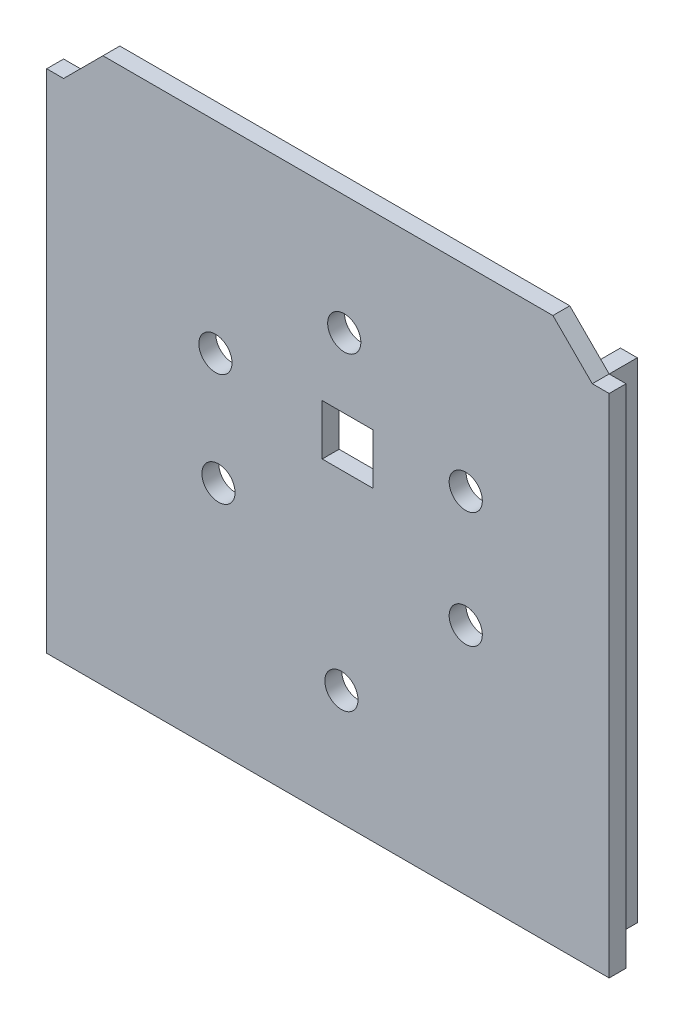
ISO-10303-21;
HEADER;
FILE_DESCRIPTION(('STEP AP214'),'2;1');
FILE_NAME('part.step','',(''),(''),'','','');
FILE_SCHEMA(('AUTOMOTIVE_DESIGN { 1 0 10303 214 1 1 1 1 }'));
ENDSEC;
DATA;
#1=APPLICATION_CONTEXT('core data for automotive mechanical design processes');
#2=APPLICATION_PROTOCOL_DEFINITION('international standard','automotive_design',2000,#1);
#3=PRODUCT_CONTEXT('',#1,'mechanical');
#4=PRODUCT('Part','Part','',(#3));
#5=PRODUCT_RELATED_PRODUCT_CATEGORY('part','',(#4));
#6=PRODUCT_DEFINITION_FORMATION('','',#4);
#7=PRODUCT_DEFINITION_CONTEXT('part definition',#1,'design');
#8=PRODUCT_DEFINITION('design','',#6,#7);
#9=PRODUCT_DEFINITION_SHAPE('','',#8);
#10=(LENGTH_UNIT() NAMED_UNIT(*) SI_UNIT(.MILLI.,.METRE.));
#11=(NAMED_UNIT(*) PLANE_ANGLE_UNIT() SI_UNIT($,.RADIAN.));
#12=(NAMED_UNIT(*) SI_UNIT($,.STERADIAN.) SOLID_ANGLE_UNIT());
#13=UNCERTAINTY_MEASURE_WITH_UNIT(LENGTH_MEASURE(1.E-05),#10,'distance_accuracy_value','');
#14=(GEOMETRIC_REPRESENTATION_CONTEXT(3) GLOBAL_UNCERTAINTY_ASSIGNED_CONTEXT((#13)) GLOBAL_UNIT_ASSIGNED_CONTEXT((#10,
#11,#12)) REPRESENTATION_CONTEXT('',''));
#15=CARTESIAN_POINT('',(0.,0.,0.));
#16=DIRECTION('',(0.,0.,1.));
#17=DIRECTION('',(1.,0.,0.));
#18=AXIS2_PLACEMENT_3D('',#15,#16,#17);
#19=CARTESIAN_POINT('',(0.,0.,-0.156260386575012));
#20=DIRECTION('',(0.,0.,-1.));
#21=DIRECTION('',(-1.,0.,0.));
#22=AXIS2_PLACEMENT_3D('',#19,#20,#21);
#23=PLANE('',#22);
#24=DIRECTION('',(0.,-1.,0.));
#25=VECTOR('',#24,1.);
#26=CARTESIAN_POINT('',(51.2611254994336,-24.011326905624,-0.156260386575012));
#27=LINE('',#26,#25);
#28=CARTESIAN_POINT('',(51.2611254994336,62.988673094376,-0.156260386575012));
#29=VERTEX_POINT('',#28);
#30=CARTESIAN_POINT('',(51.2611254994336,-24.011326905624,-0.156260386575012));
#31=VERTEX_POINT('',#30);
#32=EDGE_CURVE('E195',#29,#31,#27,.T.);
#33=ORIENTED_EDGE('',*,*,#32,.F.);
#34=DIRECTION('',(-1.,0.,0.));
#35=VECTOR('',#34,1.);
#36=CARTESIAN_POINT('',(51.2611254994336,62.988673094376,-0.156260386575012));
#37=LINE('',#36,#35);
#38=CARTESIAN_POINT('',(54.2611254994336,62.988673094376,-0.156260386575012));
#39=VERTEX_POINT('',#38);
#40=EDGE_CURVE('E291',#39,#29,#37,.T.);
#41=ORIENTED_EDGE('',*,*,#40,.F.);
#42=DIRECTION('',(0.,1.,0.));
#43=VECTOR('',#42,1.);
#44=CARTESIAN_POINT('',(54.2611254994336,62.988673094376,-0.156260386575012));
#45=LINE('',#44,#43);
#46=CARTESIAN_POINT('',(54.2611254994337,-27.011326905624,-0.156260386575012));
#47=VERTEX_POINT('',#46);
#48=EDGE_CURVE('E300',#47,#39,#45,.T.);
#49=ORIENTED_EDGE('',*,*,#48,.F.);
#50=DIRECTION('',(1.,0.,0.));
#51=VECTOR('',#50,1.);
#52=CARTESIAN_POINT('',(-45.7388745005664,-27.011326905624,-0.156260386575012));
#53=LINE('',#52,#51);
#54=CARTESIAN_POINT('',(-45.7388745005664,-27.011326905624,-0.156260386575012));
#55=VERTEX_POINT('',#54);
#56=EDGE_CURVE('E341',#55,#47,#53,.T.);
#57=ORIENTED_EDGE('',*,*,#56,.F.);
#58=DIRECTION('',(0.,-1.,0.));
#59=VECTOR('',#58,1.);
#60=CARTESIAN_POINT('',(-45.7388745005664,62.988673094376,-0.156260386575012));
#61=LINE('',#60,#59);
#62=CARTESIAN_POINT('',(-45.7388745005664,62.988673094376,-0.156260386575012));
#63=VERTEX_POINT('',#62);
#64=EDGE_CURVE('E338',#63,#55,#61,.T.);
#65=ORIENTED_EDGE('',*,*,#64,.F.);
#66=DIRECTION('',(-1.,0.,0.));
#67=VECTOR('',#66,1.);
#68=CARTESIAN_POINT('',(-42.7388745005664,62.988673094376,-0.156260386575012));
#69=LINE('',#68,#67);
#70=CARTESIAN_POINT('',(-42.7388745005664,62.988673094376,-0.156260386575012));
#71=VERTEX_POINT('',#70);
#72=EDGE_CURVE('E335',#71,#63,#69,.T.);
#73=ORIENTED_EDGE('',*,*,#72,.F.);
#74=DIRECTION('',(0.,1.,0.));
#75=VECTOR('',#74,1.);
#76=CARTESIAN_POINT('',(-42.7388745005664,62.988673094376,-0.156260386575012));
#77=LINE('',#76,#75);
#78=CARTESIAN_POINT('',(-42.7388745005664,-24.011326905624,-0.156260386575012));
#79=VERTEX_POINT('',#78);
#80=EDGE_CURVE('E394',#79,#71,#77,.T.);
#81=ORIENTED_EDGE('',*,*,#80,.F.);
#82=DIRECTION('',(-1.,0.,0.));
#83=VECTOR('',#82,1.);
#84=CARTESIAN_POINT('',(-42.7388745005664,-24.011326905624,-0.156260386575012));
#85=LINE('',#84,#83);
#86=EDGE_CURVE('E402',#31,#79,#85,.T.);
#87=ORIENTED_EDGE('',*,*,#86,.F.);
#88=EDGE_LOOP('',(#33,#41,#49,#57,#65,#73,#81,#87));
#89=FACE_BOUND('',#88,.T.);
#90=ADVANCED_FACE('F39',(#89),#23,.T.);
#91=CARTESIAN_POINT('',(0.,0.,2.84373961342499));
#92=DIRECTION('',(0.,0.,-1.));
#93=DIRECTION('',(-1.,0.,0.));
#94=AXIS2_PLACEMENT_3D('',#91,#92,#93);
#95=PLANE('',#94);
#96=CARTESIAN_POINT('',(-15.738875683346,34.1704455946526,2.84373961342499));
#97=DIRECTION('',(0.,0.,1.));
#98=DIRECTION('',(1.,0.,0.));
#99=AXIS2_PLACEMENT_3D('',#96,#97,#98);
#100=CIRCLE('',#99,2.95000117238807);
#101=CARTESIAN_POINT('',(-12.788874510958,34.1704455946526,2.84373961342499));
#102=VERTEX_POINT('',#101);
#103=EDGE_CURVE('E247',#102,#102,#100,.T.);
#104=ORIENTED_EDGE('',*,*,#103,.F.);
#105=EDGE_LOOP('',(#104));
#106=FACE_BOUND('',#105,.T.);
#107=CARTESIAN_POINT('',(-15.1988725028422,14.4704436694226,2.84373961342499));
#108=DIRECTION('',(0.,0.,1.));
#109=DIRECTION('',(1.,0.,0.));
#110=AXIS2_PLACEMENT_3D('',#107,#108,#109);
#111=CIRCLE('',#110,2.95000117238807);
#112=CARTESIAN_POINT('',(-12.2488713304541,14.4704436694226,2.84373961342499));
#113=VERTEX_POINT('',#112);
#114=EDGE_CURVE('E255',#113,#113,#111,.T.);
#115=ORIENTED_EDGE('',*,*,#114,.F.);
#116=EDGE_LOOP('',(#115));
#117=FACE_BOUND('',#116,.T.);
#118=CARTESIAN_POINT('',(6.66112724324203,-6.52955907425374,2.84373961342499));
#119=DIRECTION('',(0.,0.,1.));
#120=DIRECTION('',(1.,0.,0.));
#121=AXIS2_PLACEMENT_3D('',#118,#119,#120);
#122=CIRCLE('',#121,2.95000117238807);
#123=CARTESIAN_POINT('',(9.6111284156301,-6.52955907425374,2.84373961342499));
#124=VERTEX_POINT('',#123);
#125=EDGE_CURVE('E263',#124,#124,#122,.T.);
#126=ORIENTED_EDGE('',*,*,#125,.F.);
#127=EDGE_LOOP('',(#126));
#128=FACE_BOUND('',#127,.T.);
#129=CARTESIAN_POINT('',(28.7611250915144,14.5704434995493,2.84373961342499));
#130=DIRECTION('',(0.,0.,1.));
#131=DIRECTION('',(1.,0.,0.));
#132=AXIS2_PLACEMENT_3D('',#129,#130,#131);
#133=CIRCLE('',#132,2.95000117238806);
#134=CARTESIAN_POINT('',(31.7111262639024,14.5704434995493,2.84373961342499));
#135=VERTEX_POINT('',#134);
#136=EDGE_CURVE('E271',#135,#135,#133,.T.);
#137=ORIENTED_EDGE('',*,*,#136,.F.);
#138=EDGE_LOOP('',(#137));
#139=FACE_BOUND('',#138,.T.);
#140=CARTESIAN_POINT('',(28.7611250915144,35.1704438959202,2.84373961342499));
#141=DIRECTION('',(0.,0.,1.));
#142=DIRECTION('',(1.,0.,0.));
#143=AXIS2_PLACEMENT_3D('',#140,#141,#142);
#144=CIRCLE('',#143,2.95000117238806);
#145=CARTESIAN_POINT('',(31.7111262639024,35.1704438959202,2.84373961342499));
#146=VERTEX_POINT('',#145);
#147=EDGE_CURVE('E279',#146,#146,#144,.T.);
#148=ORIENTED_EDGE('',*,*,#147,.F.);
#149=EDGE_LOOP('',(#148));
#150=FACE_BOUND('',#149,.T.);
#151=CARTESIAN_POINT('',(7.1611245312307,48.7704431449017,2.84373961342499));
#152=DIRECTION('',(0.,0.,1.));
#153=DIRECTION('',(1.,0.,0.));
#154=AXIS2_PLACEMENT_3D('',#151,#152,#153);
#155=CIRCLE('',#154,2.95000117238807);
#156=CARTESIAN_POINT('',(10.1111257036188,48.7704431449017,2.84373961342499));
#157=VERTEX_POINT('',#156);
#158=EDGE_CURVE('E287',#157,#157,#155,.T.);
#159=ORIENTED_EDGE('',*,*,#158,.F.);
#160=EDGE_LOOP('',(#159));
#161=FACE_BOUND('',#160,.T.);
#162=DIRECTION('',(-1.,0.,0.));
#163=VECTOR('',#162,1.);
#164=CARTESIAN_POINT('',(51.2611254994336,62.988673094376,2.84373961342499));
#165=LINE('',#164,#163);
#166=CARTESIAN_POINT('',(54.2611254994336,62.988673094376,2.84373961342499));
#167=VERTEX_POINT('',#166);
#168=CARTESIAN_POINT('',(51.2611254994336,62.988673094376,2.84373961342499));
#169=VERTEX_POINT('',#168);
#170=EDGE_CURVE('E295',#167,#169,#165,.T.);
#171=ORIENTED_EDGE('',*,*,#170,.T.);
#172=DIRECTION('',(-0.707106781186551,0.707106781186544,0.));
#173=VECTOR('',#172,1.);
#174=CARTESIAN_POINT('',(51.2611254994336,62.988673094376,2.84373961342499));
#175=LINE('',#174,#173);
#176=CARTESIAN_POINT('',(44.2611254994336,69.9886730943761,2.84373961342499));
#177=VERTEX_POINT('',#176);
#178=EDGE_CURVE('E299',#169,#177,#175,.T.);
#179=ORIENTED_EDGE('',*,*,#178,.T.);
#180=DIRECTION('',(-1.,0.,0.));
#181=VECTOR('',#180,1.);
#182=CARTESIAN_POINT('',(-35.7388745005663,69.9886730943761,2.84373961342499));
#183=LINE('',#182,#181);
#184=CARTESIAN_POINT('',(-35.7388745005663,69.9886730943761,2.84373961342499));
#185=VERTEX_POINT('',#184);
#186=EDGE_CURVE('E303',#177,#185,#183,.T.);
#187=ORIENTED_EDGE('',*,*,#186,.T.);
#188=DIRECTION('',(-0.707106781186551,-0.707106781186544,0.));
#189=VECTOR('',#188,1.);
#190=CARTESIAN_POINT('',(-42.7388745005664,62.988673094376,2.84373961342499));
#191=LINE('',#190,#189);
#192=CARTESIAN_POINT('',(-42.7388745005664,62.988673094376,2.84373961342499));
#193=VERTEX_POINT('',#192);
#194=EDGE_CURVE('E306',#185,#193,#191,.T.);
#195=ORIENTED_EDGE('',*,*,#194,.T.);
#196=DIRECTION('',(-1.,0.,0.));
#197=VECTOR('',#196,1.);
#198=CARTESIAN_POINT('',(-42.7388745005664,62.988673094376,2.84373961342499));
#199=LINE('',#198,#197);
#200=CARTESIAN_POINT('',(-45.7388745005664,62.988673094376,2.84373961342499));
#201=VERTEX_POINT('',#200);
#202=EDGE_CURVE('E309',#193,#201,#199,.T.);
#203=ORIENTED_EDGE('',*,*,#202,.T.);
#204=DIRECTION('',(0.,-1.,0.));
#205=VECTOR('',#204,1.);
#206=CARTESIAN_POINT('',(-45.7388745005664,62.988673094376,2.84373961342499));
#207=LINE('',#206,#205);
#208=CARTESIAN_POINT('',(-45.7388745005664,-27.011326905624,2.84373961342499));
#209=VERTEX_POINT('',#208);
#210=EDGE_CURVE('E312',#201,#209,#207,.T.);
#211=ORIENTED_EDGE('',*,*,#210,.T.);
#212=DIRECTION('',(1.,0.,0.));
#213=VECTOR('',#212,1.);
#214=CARTESIAN_POINT('',(-45.7388745005664,-27.011326905624,2.84373961342499));
#215=LINE('',#214,#213);
#216=CARTESIAN_POINT('',(54.2611254994337,-27.011326905624,2.84373961342499));
#217=VERTEX_POINT('',#216);
#218=EDGE_CURVE('E315',#209,#217,#215,.T.);
#219=ORIENTED_EDGE('',*,*,#218,.T.);
#220=DIRECTION('',(0.,1.,0.));
#221=VECTOR('',#220,1.);
#222=CARTESIAN_POINT('',(54.2611254994336,62.988673094376,2.84373961342499));
#223=LINE('',#222,#221);
#224=EDGE_CURVE('E318',#217,#167,#223,.T.);
#225=ORIENTED_EDGE('',*,*,#224,.T.);
#226=EDGE_LOOP('',(#171,#179,#187,#195,#203,#211,#219,#225));
#227=FACE_BOUND('',#226,.T.);
#228=DIRECTION('',(0.,-1.,0.));
#229=VECTOR('',#228,1.);
#230=CARTESIAN_POINT('',(3.24857673426605,27.3921139274678,2.84373961342499));
#231=LINE('',#230,#229);
#232=CARTESIAN_POINT('',(3.24857673426605,36.3921139274678,2.84373961342499));
#233=VERTEX_POINT('',#232);
#234=CARTESIAN_POINT('',(3.24857673426605,27.3921139274678,2.84373961342499));
#235=VERTEX_POINT('',#234);
#236=EDGE_CURVE('E208',#233,#235,#231,.T.);
#237=ORIENTED_EDGE('',*,*,#236,.F.);
#238=DIRECTION('',(-1.,0.,0.));
#239=VECTOR('',#238,1.);
#240=CARTESIAN_POINT('',(3.24857673426605,36.3921139274678,2.84373961342499));
#241=LINE('',#240,#239);
#242=CARTESIAN_POINT('',(12.248576734266,36.3921139274678,2.84373961342499));
#243=VERTEX_POINT('',#242);
#244=EDGE_CURVE('E219',#243,#233,#241,.T.);
#245=ORIENTED_EDGE('',*,*,#244,.F.);
#246=DIRECTION('',(0.,1.,0.));
#247=VECTOR('',#246,1.);
#248=CARTESIAN_POINT('',(12.248576734266,27.3921139274678,2.84373961342499));
#249=LINE('',#248,#247);
#250=CARTESIAN_POINT('',(12.248576734266,27.3921139274678,2.84373961342499));
#251=VERTEX_POINT('',#250);
#252=EDGE_CURVE('E215',#251,#243,#249,.T.);
#253=ORIENTED_EDGE('',*,*,#252,.F.);
#254=DIRECTION('',(1.,0.,0.));
#255=VECTOR('',#254,1.);
#256=CARTESIAN_POINT('',(3.24857673426605,27.3921139274678,2.84373961342499));
#257=LINE('',#256,#255);
#258=EDGE_CURVE('E211',#235,#251,#257,.T.);
#259=ORIENTED_EDGE('',*,*,#258,.F.);
#260=EDGE_LOOP('',(#237,#245,#253,#259));
#261=FACE_BOUND('',#260,.T.);
#262=ADVANCED_FACE('F483',(#106,#117,#128,#139,#150,#161,#227,#261),#95,.F.);
#263=DIRECTION('',(1.,0.,0.));
#264=VECTOR('',#263,1.);
#265=CARTESIAN_POINT('',(51.2611254994336,62.988673094376,-0.156260386575012));
#266=LINE('',#265,#264);
#267=CARTESIAN_POINT('',(48.2611254994336,62.988673094376,-0.156260386575012));
#268=VERTEX_POINT('',#267);
#269=EDGE_CURVE('E55',#268,#29,#266,.T.);
#270=ORIENTED_EDGE('',*,*,#269,.F.);
#271=DIRECTION('',(0.,1.,0.));
#272=VECTOR('',#271,1.);
#273=CARTESIAN_POINT('',(48.2611254994336,62.988673094376,-0.156260386575012));
#274=LINE('',#273,#272);
#275=CARTESIAN_POINT('',(48.2611254994336,-21.011326905624,-0.156260386575012));
#276=VERTEX_POINT('',#275);
#277=EDGE_CURVE('E59',#276,#268,#274,.T.);
#278=ORIENTED_EDGE('',*,*,#277,.F.);
#279=DIRECTION('',(1.,0.,0.));
#280=VECTOR('',#279,1.);
#281=CARTESIAN_POINT('',(48.2611254994336,-21.011326905624,-0.156260386575012));
#282=LINE('',#281,#280);
#283=CARTESIAN_POINT('',(-39.7388745005664,-21.011326905624,-0.156260386575012));
#284=VERTEX_POINT('',#283);
#285=EDGE_CURVE('E433',#284,#276,#282,.T.);
#286=ORIENTED_EDGE('',*,*,#285,.F.);
#287=DIRECTION('',(0.,-1.,0.));
#288=VECTOR('',#287,1.);
#289=CARTESIAN_POINT('',(-39.7388745005664,-21.011326905624,-0.156260386575012));
#290=LINE('',#289,#288);
#291=CARTESIAN_POINT('',(-39.7388745005664,62.988673094376,-0.156260386575012));
#292=VERTEX_POINT('',#291);
#293=EDGE_CURVE('E436',#292,#284,#290,.T.);
#294=ORIENTED_EDGE('',*,*,#293,.F.);
#295=DIRECTION('',(1.,0.,0.));
#296=VECTOR('',#295,1.);
#297=CARTESIAN_POINT('',(-39.7388745005664,62.988673094376,-0.156260386575012));
#298=LINE('',#297,#296);
#299=EDGE_CURVE('E381',#71,#292,#298,.T.);
#300=ORIENTED_EDGE('',*,*,#299,.F.);
#301=DIRECTION('',(-0.707106781186551,-0.707106781186544,0.));
#302=VECTOR('',#301,1.);
#303=CARTESIAN_POINT('',(-42.7388745005664,62.988673094376,-0.156260386575012));
#304=LINE('',#303,#302);
#305=CARTESIAN_POINT('',(-35.7388745005663,69.9886730943761,-0.156260386575012));
#306=VERTEX_POINT('',#305);
#307=EDGE_CURVE('E331',#306,#71,#304,.T.);
#308=ORIENTED_EDGE('',*,*,#307,.F.);
#309=DIRECTION('',(-1.,0.,0.));
#310=VECTOR('',#309,1.);
#311=CARTESIAN_POINT('',(-35.7388745005663,69.9886730943761,-0.156260386575012));
#312=LINE('',#311,#310);
#313=CARTESIAN_POINT('',(44.2611254994336,69.9886730943761,-0.156260386575012));
#314=VERTEX_POINT('',#313);
#315=EDGE_CURVE('E328',#314,#306,#312,.T.);
#316=ORIENTED_EDGE('',*,*,#315,.F.);
#317=DIRECTION('',(-0.707106781186551,0.707106781186544,0.));
#318=VECTOR('',#317,1.);
#319=CARTESIAN_POINT('',(51.2611254994336,62.988673094376,-0.156260386575012));
#320=LINE('',#319,#318);
#321=EDGE_CURVE('E325',#29,#314,#320,.T.);
#322=ORIENTED_EDGE('',*,*,#321,.F.);
#323=EDGE_LOOP('',(#270,#278,#286,#294,#300,#308,#316,#322));
#324=FACE_BOUND('',#323,.T.);
#325=CARTESIAN_POINT('',(-15.1988725028422,14.4704436694226,-0.156260386575012));
#326=DIRECTION('',(0.,0.,1.));
#327=DIRECTION('',(1.,0.,0.));
#328=AXIS2_PLACEMENT_3D('',#325,#326,#327);
#329=CIRCLE('',#328,2.95000117238807);
#330=CARTESIAN_POINT('',(-12.2488713304541,14.4704436694226,-0.156260386575012));
#331=VERTEX_POINT('',#330);
#332=EDGE_CURVE('E251',#331,#331,#329,.T.);
#333=ORIENTED_EDGE('',*,*,#332,.T.);
#334=EDGE_LOOP('',(#333));
#335=FACE_BOUND('',#334,.T.);
#336=CARTESIAN_POINT('',(28.7611250915144,14.5704434995493,-0.156260386575012));
#337=DIRECTION('',(0.,0.,1.));
#338=DIRECTION('',(1.,0.,0.));
#339=AXIS2_PLACEMENT_3D('',#336,#337,#338);
#340=CIRCLE('',#339,2.95000117238806);
#341=CARTESIAN_POINT('',(31.7111262639024,14.5704434995493,-0.156260386575012));
#342=VERTEX_POINT('',#341);
#343=EDGE_CURVE('E267',#342,#342,#340,.T.);
#344=ORIENTED_EDGE('',*,*,#343,.T.);
#345=EDGE_LOOP('',(#344));
#346=FACE_BOUND('',#345,.T.);
#347=CARTESIAN_POINT('',(7.1611245312307,48.7704431449017,-0.156260386575012));
#348=DIRECTION('',(0.,0.,1.));
#349=DIRECTION('',(1.,0.,0.));
#350=AXIS2_PLACEMENT_3D('',#347,#348,#349);
#351=CIRCLE('',#350,2.95000117238807);
#352=CARTESIAN_POINT('',(10.1111257036188,48.7704431449017,-0.156260386575012));
#353=VERTEX_POINT('',#352);
#354=EDGE_CURVE('E283',#353,#353,#351,.T.);
#355=ORIENTED_EDGE('',*,*,#354,.T.);
#356=EDGE_LOOP('',(#355));
#357=FACE_BOUND('',#356,.T.);
#358=CARTESIAN_POINT('',(28.7611250915144,35.1704438959202,-0.156260386575012));
#359=DIRECTION('',(0.,0.,1.));
#360=DIRECTION('',(1.,0.,0.));
#361=AXIS2_PLACEMENT_3D('',#358,#359,#360);
#362=CIRCLE('',#361,2.95000117238806);
#363=CARTESIAN_POINT('',(31.7111262639024,35.1704438959202,-0.156260386575012));
#364=VERTEX_POINT('',#363);
#365=EDGE_CURVE('E275',#364,#364,#362,.T.);
#366=ORIENTED_EDGE('',*,*,#365,.T.);
#367=EDGE_LOOP('',(#366));
#368=FACE_BOUND('',#367,.T.);
#369=CARTESIAN_POINT('',(6.66112724324203,-6.52955907425374,-0.156260386575012));
#370=DIRECTION('',(0.,0.,1.));
#371=DIRECTION('',(1.,0.,0.));
#372=AXIS2_PLACEMENT_3D('',#369,#370,#371);
#373=CIRCLE('',#372,2.95000117238807);
#374=CARTESIAN_POINT('',(9.6111284156301,-6.52955907425374,-0.156260386575012));
#375=VERTEX_POINT('',#374);
#376=EDGE_CURVE('E259',#375,#375,#373,.T.);
#377=ORIENTED_EDGE('',*,*,#376,.T.);
#378=EDGE_LOOP('',(#377));
#379=FACE_BOUND('',#378,.T.);
#380=CARTESIAN_POINT('',(-15.738875683346,34.1704455946526,-0.156260386575012));
#381=DIRECTION('',(0.,0.,1.));
#382=DIRECTION('',(1.,0.,0.));
#383=AXIS2_PLACEMENT_3D('',#380,#381,#382);
#384=CIRCLE('',#383,2.95000117238807);
#385=CARTESIAN_POINT('',(-12.788874510958,34.1704455946526,-0.156260386575012));
#386=VERTEX_POINT('',#385);
#387=EDGE_CURVE('E246',#386,#386,#384,.T.);
#388=ORIENTED_EDGE('',*,*,#387,.T.);
#389=EDGE_LOOP('',(#388));
#390=FACE_BOUND('',#389,.T.);
#391=DIRECTION('',(-1.,0.,0.));
#392=VECTOR('',#391,1.);
#393=CARTESIAN_POINT('',(3.24857673426605,36.3921139274678,-0.156260386575012));
#394=LINE('',#393,#392);
#395=CARTESIAN_POINT('',(12.248576734266,36.3921139274678,-0.156260386575012));
#396=VERTEX_POINT('',#395);
#397=CARTESIAN_POINT('',(3.24857673426605,36.3921139274678,-0.156260386575012));
#398=VERTEX_POINT('',#397);
#399=EDGE_CURVE('E212',#396,#398,#394,.T.);
#400=ORIENTED_EDGE('',*,*,#399,.T.);
#401=DIRECTION('',(0.,-1.,0.));
#402=VECTOR('',#401,1.);
#403=CARTESIAN_POINT('',(3.24857673426605,27.3921139274678,-0.156260386575012));
#404=LINE('',#403,#402);
#405=CARTESIAN_POINT('',(3.24857673426605,27.3921139274678,-0.156260386575012));
#406=VERTEX_POINT('',#405);
#407=EDGE_CURVE('E197',#398,#406,#404,.T.);
#408=ORIENTED_EDGE('',*,*,#407,.T.);
#409=DIRECTION('',(1.,0.,0.));
#410=VECTOR('',#409,1.);
#411=CARTESIAN_POINT('',(3.24857673426605,27.3921139274678,-0.156260386575012));
#412=LINE('',#411,#410);
#413=CARTESIAN_POINT('',(12.248576734266,27.3921139274678,-0.156260386575012));
#414=VERTEX_POINT('',#413);
#415=EDGE_CURVE('E202',#406,#414,#412,.T.);
#416=ORIENTED_EDGE('',*,*,#415,.T.);
#417=DIRECTION('',(0.,1.,0.));
#418=VECTOR('',#417,1.);
#419=CARTESIAN_POINT('',(12.248576734266,27.3921139274678,-0.156260386575012));
#420=LINE('',#419,#418);
#421=EDGE_CURVE('E226',#414,#396,#420,.T.);
#422=ORIENTED_EDGE('',*,*,#421,.T.);
#423=EDGE_LOOP('',(#400,#408,#416,#422));
#424=FACE_BOUND('',#423,.T.);
#425=ADVANCED_FACE('F378',(#324,#335,#346,#357,#368,#379,#390,#424),#23,.T.);
#426=CARTESIAN_POINT('',(51.2611254994336,62.988673094376,2.84373961342499));
#427=DIRECTION('',(0.,-1.,0.));
#428=DIRECTION('',(0.,0.,-1.));
#429=AXIS2_PLACEMENT_3D('',#426,#427,#428);
#430=PLANE('',#429);
#431=ORIENTED_EDGE('',*,*,#40,.T.);
#432=DIRECTION('',(0.,0.,-1.));
#433=VECTOR('',#432,1.);
#434=CARTESIAN_POINT('',(51.2611254994336,62.988673094376,2.84373961342499));
#435=LINE('',#434,#433);
#436=EDGE_CURVE('E11',#169,#29,#435,.T.);
#437=ORIENTED_EDGE('',*,*,#436,.F.);
#438=ORIENTED_EDGE('',*,*,#170,.F.);
#439=DIRECTION('',(0.,0.,-1.));
#440=VECTOR('',#439,1.);
#441=CARTESIAN_POINT('',(54.2611254994336,62.988673094376,2.84373961342499));
#442=LINE('',#441,#440);
#443=EDGE_CURVE('E321',#167,#39,#442,.T.);
#444=ORIENTED_EDGE('',*,*,#443,.T.);
#445=EDGE_LOOP('',(#431,#437,#438,#444));
#446=FACE_BOUND('',#445,.T.);
#447=ADVANCED_FACE('F41',(#446),#430,.F.);
#448=CARTESIAN_POINT('',(51.2611254994336,62.988673094376,2.84373961342499));
#449=DIRECTION('',(-0.707106781186544,-0.707106781186551,0.));
#450=DIRECTION('',(0.707106781186551,-0.707106781186544,0.));
#451=AXIS2_PLACEMENT_3D('',#448,#449,#450);
#452=PLANE('',#451);
#453=ORIENTED_EDGE('',*,*,#321,.T.);
#454=DIRECTION('',(0.,0.,-1.));
#455=VECTOR('',#454,1.);
#456=CARTESIAN_POINT('',(44.2611254994336,69.9886730943761,2.84373961342499));
#457=LINE('',#456,#455);
#458=EDGE_CURVE('E48',#177,#314,#457,.T.);
#459=ORIENTED_EDGE('',*,*,#458,.F.);
#460=ORIENTED_EDGE('',*,*,#178,.F.);
#461=ORIENTED_EDGE('',*,*,#436,.T.);
#462=EDGE_LOOP('',(#453,#459,#460,#461));
#463=FACE_BOUND('',#462,.T.);
#464=ADVANCED_FACE('F495',(#463),#452,.F.);
#465=CARTESIAN_POINT('',(-35.7388745005663,69.9886730943761,2.84373961342499));
#466=DIRECTION('',(0.,-1.,0.));
#467=DIRECTION('',(0.,0.,-1.));
#468=AXIS2_PLACEMENT_3D('',#465,#466,#467);
#469=PLANE('',#468);
#470=ORIENTED_EDGE('',*,*,#315,.T.);
#471=DIRECTION('',(0.,0.,-1.));
#472=VECTOR('',#471,1.);
#473=CARTESIAN_POINT('',(-35.7388745005663,69.9886730943761,2.84373961342499));
#474=LINE('',#473,#472);
#475=EDGE_CURVE('E365',#185,#306,#474,.T.);
#476=ORIENTED_EDGE('',*,*,#475,.F.);
#477=ORIENTED_EDGE('',*,*,#186,.F.);
#478=ORIENTED_EDGE('',*,*,#458,.T.);
#479=EDGE_LOOP('',(#470,#476,#477,#478));
#480=FACE_BOUND('',#479,.T.);
#481=ADVANCED_FACE('F374',(#480),#469,.F.);
#482=CARTESIAN_POINT('',(-42.7388745005664,62.988673094376,2.84373961342499));
#483=DIRECTION('',(0.707106781186544,-0.707106781186551,0.));
#484=DIRECTION('',(0.707106781186551,0.707106781186544,0.));
#485=AXIS2_PLACEMENT_3D('',#482,#483,#484);
#486=PLANE('',#485);
#487=ORIENTED_EDGE('',*,*,#307,.T.);
#488=DIRECTION('',(0.,0.,-1.));
#489=VECTOR('',#488,1.);
#490=CARTESIAN_POINT('',(-42.7388745005664,62.988673094376,2.84373961342499));
#491=LINE('',#490,#489);
#492=EDGE_CURVE('E361',#193,#71,#491,.T.);
#493=ORIENTED_EDGE('',*,*,#492,.F.);
#494=ORIENTED_EDGE('',*,*,#194,.F.);
#495=ORIENTED_EDGE('',*,*,#475,.T.);
#496=EDGE_LOOP('',(#487,#493,#494,#495));
#497=FACE_BOUND('',#496,.T.);
#498=ADVANCED_FACE('F384',(#497),#486,.F.);
#499=CARTESIAN_POINT('',(-42.7388745005664,62.988673094376,2.84373961342499));
#500=DIRECTION('',(0.,-1.,0.));
#501=DIRECTION('',(0.,0.,-1.));
#502=AXIS2_PLACEMENT_3D('',#499,#500,#501);
#503=PLANE('',#502);
#504=ORIENTED_EDGE('',*,*,#72,.T.);
#505=DIRECTION('',(0.,0.,-1.));
#506=VECTOR('',#505,1.);
#507=CARTESIAN_POINT('',(-45.7388745005664,62.988673094376,2.84373961342499));
#508=LINE('',#507,#506);
#509=EDGE_CURVE('E357',#201,#63,#508,.T.);
#510=ORIENTED_EDGE('',*,*,#509,.F.);
#511=ORIENTED_EDGE('',*,*,#202,.F.);
#512=ORIENTED_EDGE('',*,*,#492,.T.);
#513=EDGE_LOOP('',(#504,#510,#511,#512));
#514=FACE_BOUND('',#513,.T.);
#515=ADVANCED_FACE('F389',(#514),#503,.F.);
#516=CARTESIAN_POINT('',(-45.7388745005664,62.988673094376,2.84373961342499));
#517=DIRECTION('',(1.,0.,0.));
#518=DIRECTION('',(0.,1.,0.));
#519=AXIS2_PLACEMENT_3D('',#516,#517,#518);
#520=PLANE('',#519);
#521=ORIENTED_EDGE('',*,*,#64,.T.);
#522=DIRECTION('',(0.,0.,-1.));
#523=VECTOR('',#522,1.);
#524=CARTESIAN_POINT('',(-45.7388745005664,-27.011326905624,2.84373961342499));
#525=LINE('',#524,#523);
#526=EDGE_CURVE('E353',#209,#55,#525,.T.);
#527=ORIENTED_EDGE('',*,*,#526,.F.);
#528=ORIENTED_EDGE('',*,*,#210,.F.);
#529=ORIENTED_EDGE('',*,*,#509,.T.);
#530=EDGE_LOOP('',(#521,#527,#528,#529));
#531=FACE_BOUND('',#530,.T.);
#532=ADVANCED_FACE('F515',(#531),#520,.F.);
#533=CARTESIAN_POINT('',(-45.7388745005664,-27.011326905624,2.84373961342499));
#534=DIRECTION('',(0.,1.,0.));
#535=DIRECTION('',(-1.,0.,0.));
#536=AXIS2_PLACEMENT_3D('',#533,#534,#535);
#537=PLANE('',#536);
#538=ORIENTED_EDGE('',*,*,#56,.T.);
#539=DIRECTION('',(0.,0.,-1.));
#540=VECTOR('',#539,1.);
#541=CARTESIAN_POINT('',(54.2611254994337,-27.011326905624,2.84373961342499));
#542=LINE('',#541,#540);
#543=EDGE_CURVE('E349',#217,#47,#542,.T.);
#544=ORIENTED_EDGE('',*,*,#543,.F.);
#545=ORIENTED_EDGE('',*,*,#218,.F.);
#546=ORIENTED_EDGE('',*,*,#526,.T.);
#547=EDGE_LOOP('',(#538,#544,#545,#546));
#548=FACE_BOUND('',#547,.T.);
#549=ADVANCED_FACE('F511',(#548),#537,.F.);
#550=CARTESIAN_POINT('',(54.2611254994336,62.988673094376,2.84373961342499));
#551=DIRECTION('',(-1.,0.,0.));
#552=DIRECTION('',(0.,-1.,0.));
#553=AXIS2_PLACEMENT_3D('',#550,#551,#552);
#554=PLANE('',#553);
#555=ORIENTED_EDGE('',*,*,#48,.T.);
#556=ORIENTED_EDGE('',*,*,#443,.F.);
#557=ORIENTED_EDGE('',*,*,#224,.F.);
#558=ORIENTED_EDGE('',*,*,#543,.T.);
#559=EDGE_LOOP('',(#555,#556,#557,#558));
#560=FACE_BOUND('',#559,.T.);
#561=ADVANCED_FACE('F506',(#560),#554,.F.);
#562=CARTESIAN_POINT('',(7.1611245312307,48.7704431449017,2.84373961342499));
#563=DIRECTION('',(0.,0.,-1.));
#564=DIRECTION('',(-1.,0.,0.));
#565=AXIS2_PLACEMENT_3D('',#562,#563,#564);
#566=CYLINDRICAL_SURFACE('',#565,2.95000117238807);
#567=ORIENTED_EDGE('',*,*,#158,.T.);
#568=EDGE_LOOP('',(#567));
#569=FACE_BOUND('',#568,.T.);
#570=ORIENTED_EDGE('',*,*,#354,.F.);
#571=EDGE_LOOP('',(#570));
#572=FACE_BOUND('',#571,.T.);
#573=ADVANCED_FACE('F567',(#569,#572),#566,.F.);
#574=CARTESIAN_POINT('',(28.7611250915144,35.1704438959202,2.84373961342499));
#575=DIRECTION('',(0.,0.,-1.));
#576=DIRECTION('',(-1.,0.,0.));
#577=AXIS2_PLACEMENT_3D('',#574,#575,#576);
#578=CYLINDRICAL_SURFACE('',#577,2.95000117238806);
#579=ORIENTED_EDGE('',*,*,#147,.T.);
#580=EDGE_LOOP('',(#579));
#581=FACE_BOUND('',#580,.T.);
#582=ORIENTED_EDGE('',*,*,#365,.F.);
#583=EDGE_LOOP('',(#582));
#584=FACE_BOUND('',#583,.T.);
#585=ADVANCED_FACE('F563',(#581,#584),#578,.F.);
#586=CARTESIAN_POINT('',(28.7611250915144,14.5704434995493,2.84373961342499));
#587=DIRECTION('',(0.,0.,-1.));
#588=DIRECTION('',(-1.,0.,0.));
#589=AXIS2_PLACEMENT_3D('',#586,#587,#588);
#590=CYLINDRICAL_SURFACE('',#589,2.95000117238806);
#591=ORIENTED_EDGE('',*,*,#136,.T.);
#592=EDGE_LOOP('',(#591));
#593=FACE_BOUND('',#592,.T.);
#594=ORIENTED_EDGE('',*,*,#343,.F.);
#595=EDGE_LOOP('',(#594));
#596=FACE_BOUND('',#595,.T.);
#597=ADVANCED_FACE('F559',(#593,#596),#590,.F.);
#598=CARTESIAN_POINT('',(6.66112724324203,-6.52955907425374,2.84373961342499));
#599=DIRECTION('',(0.,0.,-1.));
#600=DIRECTION('',(-1.,0.,0.));
#601=AXIS2_PLACEMENT_3D('',#598,#599,#600);
#602=CYLINDRICAL_SURFACE('',#601,2.95000117238807);
#603=ORIENTED_EDGE('',*,*,#125,.T.);
#604=EDGE_LOOP('',(#603));
#605=FACE_BOUND('',#604,.T.);
#606=ORIENTED_EDGE('',*,*,#376,.F.);
#607=EDGE_LOOP('',(#606));
#608=FACE_BOUND('',#607,.T.);
#609=ADVANCED_FACE('F555',(#605,#608),#602,.F.);
#610=CARTESIAN_POINT('',(-15.1988725028422,14.4704436694226,2.84373961342499));
#611=DIRECTION('',(0.,0.,-1.));
#612=DIRECTION('',(-1.,0.,0.));
#613=AXIS2_PLACEMENT_3D('',#610,#611,#612);
#614=CYLINDRICAL_SURFACE('',#613,2.95000117238807);
#615=ORIENTED_EDGE('',*,*,#114,.T.);
#616=EDGE_LOOP('',(#615));
#617=FACE_BOUND('',#616,.T.);
#618=ORIENTED_EDGE('',*,*,#332,.F.);
#619=EDGE_LOOP('',(#618));
#620=FACE_BOUND('',#619,.T.);
#621=ADVANCED_FACE('F551',(#617,#620),#614,.F.);
#622=CARTESIAN_POINT('',(-15.738875683346,34.1704455946526,2.84373961342499));
#623=DIRECTION('',(0.,0.,-1.));
#624=DIRECTION('',(-1.,0.,0.));
#625=AXIS2_PLACEMENT_3D('',#622,#623,#624);
#626=CYLINDRICAL_SURFACE('',#625,2.95000117238807);
#627=ORIENTED_EDGE('',*,*,#103,.T.);
#628=EDGE_LOOP('',(#627));
#629=FACE_BOUND('',#628,.T.);
#630=ORIENTED_EDGE('',*,*,#387,.F.);
#631=EDGE_LOOP('',(#630));
#632=FACE_BOUND('',#631,.T.);
#633=ADVANCED_FACE('F548',(#629,#632),#626,.F.);
#634=CARTESIAN_POINT('',(3.24857673426605,27.3921139274678,2.84373961342499));
#635=DIRECTION('',(1.,0.,0.));
#636=DIRECTION('',(0.,0.,-1.));
#637=AXIS2_PLACEMENT_3D('',#634,#635,#636);
#638=PLANE('',#637);
#639=ORIENTED_EDGE('',*,*,#407,.F.);
#640=DIRECTION('',(0.,0.,-1.));
#641=VECTOR('',#640,1.);
#642=CARTESIAN_POINT('',(3.24857673426605,36.3921139274678,2.84373961342499));
#643=LINE('',#642,#641);
#644=EDGE_CURVE('E221',#233,#398,#643,.T.);
#645=ORIENTED_EDGE('',*,*,#644,.F.);
#646=ORIENTED_EDGE('',*,*,#236,.T.);
#647=DIRECTION('',(0.,0.,-1.));
#648=VECTOR('',#647,1.);
#649=CARTESIAN_POINT('',(3.24857673426605,27.3921139274678,2.84373961342499));
#650=LINE('',#649,#648);
#651=EDGE_CURVE('E242',#235,#406,#650,.T.);
#652=ORIENTED_EDGE('',*,*,#651,.T.);
#653=EDGE_LOOP('',(#639,#645,#646,#652));
#654=FACE_BOUND('',#653,.T.);
#655=ADVANCED_FACE('F525',(#654),#638,.T.);
#656=CARTESIAN_POINT('',(3.24857673426605,27.3921139274678,2.84373961342499));
#657=DIRECTION('',(0.,1.,0.));
#658=DIRECTION('',(0.,0.,1.));
#659=AXIS2_PLACEMENT_3D('',#656,#657,#658);
#660=PLANE('',#659);
#661=ORIENTED_EDGE('',*,*,#415,.F.);
#662=ORIENTED_EDGE('',*,*,#651,.F.);
#663=ORIENTED_EDGE('',*,*,#258,.T.);
#664=DIRECTION('',(0.,0.,-1.));
#665=VECTOR('',#664,1.);
#666=CARTESIAN_POINT('',(12.248576734266,27.3921139274678,2.84373961342499));
#667=LINE('',#666,#665);
#668=EDGE_CURVE('E239',#251,#414,#667,.T.);
#669=ORIENTED_EDGE('',*,*,#668,.T.);
#670=EDGE_LOOP('',(#661,#662,#663,#669));
#671=FACE_BOUND('',#670,.T.);
#672=ADVANCED_FACE('F527',(#671),#660,.T.);
#673=CARTESIAN_POINT('',(12.248576734266,27.3921139274678,2.84373961342499));
#674=DIRECTION('',(-1.,0.,0.));
#675=DIRECTION('',(0.,0.,1.));
#676=AXIS2_PLACEMENT_3D('',#673,#674,#675);
#677=PLANE('',#676);
#678=ORIENTED_EDGE('',*,*,#421,.F.);
#679=ORIENTED_EDGE('',*,*,#668,.F.);
#680=ORIENTED_EDGE('',*,*,#252,.T.);
#681=DIRECTION('',(0.,0.,-1.));
#682=VECTOR('',#681,1.);
#683=CARTESIAN_POINT('',(12.248576734266,36.3921139274678,2.84373961342499));
#684=LINE('',#683,#682);
#685=EDGE_CURVE('E236',#243,#396,#684,.T.);
#686=ORIENTED_EDGE('',*,*,#685,.T.);
#687=EDGE_LOOP('',(#678,#679,#680,#686));
#688=FACE_BOUND('',#687,.T.);
#689=ADVANCED_FACE('F535',(#688),#677,.T.);
#690=CARTESIAN_POINT('',(3.24857673426605,36.3921139274678,2.84373961342499));
#691=DIRECTION('',(0.,-1.,0.));
#692=DIRECTION('',(0.,0.,-1.));
#693=AXIS2_PLACEMENT_3D('',#690,#691,#692);
#694=PLANE('',#693);
#695=ORIENTED_EDGE('',*,*,#399,.F.);
#696=ORIENTED_EDGE('',*,*,#685,.F.);
#697=ORIENTED_EDGE('',*,*,#244,.T.);
#698=ORIENTED_EDGE('',*,*,#644,.T.);
#699=EDGE_LOOP('',(#695,#696,#697,#698));
#700=FACE_BOUND('',#699,.T.);
#701=ADVANCED_FACE('F533',(#700),#694,.T.);
#702=CARTESIAN_POINT('',(51.2611254994336,-24.011326905624,-5.15626038657501));
#703=DIRECTION('',(-1.,0.,0.));
#704=DIRECTION('',(0.,0.,1.));
#705=AXIS2_PLACEMENT_3D('',#702,#703,#704);
#706=PLANE('',#705);
#707=ORIENTED_EDGE('',*,*,#32,.T.);
#708=DIRECTION('',(0.,0.,1.));
#709=VECTOR('',#708,1.);
#710=CARTESIAN_POINT('',(51.2611254994336,-24.011326905624,-5.15626038657501));
#711=LINE('',#710,#709);
#712=CARTESIAN_POINT('',(51.2611254994336,-24.011326905624,-5.15626038657501));
#713=VERTEX_POINT('',#712);
#714=EDGE_CURVE('E175',#713,#31,#711,.T.);
#715=ORIENTED_EDGE('',*,*,#714,.F.);
#716=DIRECTION('',(0.,-1.,0.));
#717=VECTOR('',#716,1.);
#718=CARTESIAN_POINT('',(51.2611254994336,-24.011326905624,-5.15626038657501));
#719=LINE('',#718,#717);
#720=CARTESIAN_POINT('',(51.2611254994336,62.988673094376,-5.15626038657501));
#721=VERTEX_POINT('',#720);
#722=EDGE_CURVE('E183',#721,#713,#719,.T.);
#723=ORIENTED_EDGE('',*,*,#722,.F.);
#724=DIRECTION('',(0.,0.,1.));
#725=VECTOR('',#724,1.);
#726=CARTESIAN_POINT('',(51.2611254994336,62.988673094376,-5.15626038657501));
#727=LINE('',#726,#725);
#728=EDGE_CURVE('E426',#721,#29,#727,.T.);
#729=ORIENTED_EDGE('',*,*,#728,.T.);
#730=EDGE_LOOP('',(#707,#715,#723,#729));
#731=FACE_BOUND('',#730,.T.);
#732=ADVANCED_FACE('F194',(#731),#706,.F.);
#733=CARTESIAN_POINT('',(-42.7388745005664,-24.011326905624,-5.15626038657501));
#734=DIRECTION('',(0.,1.,0.));
#735=DIRECTION('',(-1.,0.,0.));
#736=AXIS2_PLACEMENT_3D('',#733,#734,#735);
#737=PLANE('',#736);
#738=ORIENTED_EDGE('',*,*,#86,.T.);
#739=DIRECTION('',(0.,0.,1.));
#740=VECTOR('',#739,1.);
#741=CARTESIAN_POINT('',(-42.7388745005664,-24.011326905624,-5.15626038657501));
#742=LINE('',#741,#740);
#743=CARTESIAN_POINT('',(-42.7388745005664,-24.011326905624,-5.15626038657501));
#744=VERTEX_POINT('',#743);
#745=EDGE_CURVE('E178',#744,#79,#742,.T.);
#746=ORIENTED_EDGE('',*,*,#745,.F.);
#747=DIRECTION('',(-1.,0.,0.));
#748=VECTOR('',#747,1.);
#749=CARTESIAN_POINT('',(-42.7388745005664,-24.011326905624,-5.15626038657501));
#750=LINE('',#749,#748);
#751=EDGE_CURVE('E170',#713,#744,#750,.T.);
#752=ORIENTED_EDGE('',*,*,#751,.F.);
#753=ORIENTED_EDGE('',*,*,#714,.T.);
#754=EDGE_LOOP('',(#738,#746,#752,#753));
#755=FACE_BOUND('',#754,.T.);
#756=ADVANCED_FACE('F173',(#755),#737,.F.);
#757=CARTESIAN_POINT('',(-42.7388745005664,62.988673094376,-5.15626038657501));
#758=DIRECTION('',(1.,0.,0.));
#759=DIRECTION('',(0.,1.,0.));
#760=AXIS2_PLACEMENT_3D('',#757,#758,#759);
#761=PLANE('',#760);
#762=ORIENTED_EDGE('',*,*,#80,.T.);
#763=DIRECTION('',(0.,0.,1.));
#764=VECTOR('',#763,1.);
#765=CARTESIAN_POINT('',(-42.7388745005664,62.988673094376,-5.15626038657501));
#766=LINE('',#765,#764);
#767=CARTESIAN_POINT('',(-42.7388745005664,62.988673094376,-5.15626038657501));
#768=VERTEX_POINT('',#767);
#769=EDGE_CURVE('E204',#768,#71,#766,.T.);
#770=ORIENTED_EDGE('',*,*,#769,.F.);
#771=DIRECTION('',(0.,1.,0.));
#772=VECTOR('',#771,1.);
#773=CARTESIAN_POINT('',(-42.7388745005664,62.988673094376,-5.15626038657501));
#774=LINE('',#773,#772);
#775=EDGE_CURVE('E182',#744,#768,#774,.T.);
#776=ORIENTED_EDGE('',*,*,#775,.F.);
#777=ORIENTED_EDGE('',*,*,#745,.T.);
#778=EDGE_LOOP('',(#762,#770,#776,#777));
#779=FACE_BOUND('',#778,.T.);
#780=ADVANCED_FACE('F399',(#779),#761,.F.);
#781=CARTESIAN_POINT('',(-39.7388745005664,62.988673094376,-5.15626038657501));
#782=DIRECTION('',(0.,-1.,0.));
#783=DIRECTION('',(1.,0.,0.));
#784=AXIS2_PLACEMENT_3D('',#781,#782,#783);
#785=PLANE('',#784);
#786=ORIENTED_EDGE('',*,*,#299,.T.);
#787=DIRECTION('',(0.,0.,1.));
#788=VECTOR('',#787,1.);
#789=CARTESIAN_POINT('',(-39.7388745005664,62.988673094376,-5.15626038657501));
#790=LINE('',#789,#788);
#791=CARTESIAN_POINT('',(-39.7388745005664,62.988673094376,-5.15626038657501));
#792=VERTEX_POINT('',#791);
#793=EDGE_CURVE('E410',#792,#292,#790,.T.);
#794=ORIENTED_EDGE('',*,*,#793,.F.);
#795=DIRECTION('',(1.,0.,0.));
#796=VECTOR('',#795,1.);
#797=CARTESIAN_POINT('',(-39.7388745005664,62.988673094376,-5.15626038657501));
#798=LINE('',#797,#796);
#799=EDGE_CURVE('E408',#768,#792,#798,.T.);
#800=ORIENTED_EDGE('',*,*,#799,.F.);
#801=ORIENTED_EDGE('',*,*,#769,.T.);
#802=EDGE_LOOP('',(#786,#794,#800,#801));
#803=FACE_BOUND('',#802,.T.);
#804=ADVANCED_FACE('F405',(#803),#785,.F.);
#805=CARTESIAN_POINT('',(-39.7388745005664,-21.011326905624,-5.15626038657501));
#806=DIRECTION('',(-1.,0.,0.));
#807=DIRECTION('',(0.,0.,1.));
#808=AXIS2_PLACEMENT_3D('',#805,#806,#807);
#809=PLANE('',#808);
#810=ORIENTED_EDGE('',*,*,#293,.T.);
#811=DIRECTION('',(0.,0.,1.));
#812=VECTOR('',#811,1.);
#813=CARTESIAN_POINT('',(-39.7388745005664,-21.011326905624,-5.15626038657501));
#814=LINE('',#813,#812);
#815=CARTESIAN_POINT('',(-39.7388745005664,-21.011326905624,-5.15626038657501));
#816=VERTEX_POINT('',#815);
#817=EDGE_CURVE('E412',#816,#284,#814,.T.);
#818=ORIENTED_EDGE('',*,*,#817,.F.);
#819=DIRECTION('',(0.,-1.,0.));
#820=VECTOR('',#819,1.);
#821=CARTESIAN_POINT('',(-39.7388745005664,-21.011326905624,-5.15626038657501));
#822=LINE('',#821,#820);
#823=EDGE_CURVE('E454',#792,#816,#822,.T.);
#824=ORIENTED_EDGE('',*,*,#823,.F.);
#825=ORIENTED_EDGE('',*,*,#793,.T.);
#826=EDGE_LOOP('',(#810,#818,#824,#825));
#827=FACE_BOUND('',#826,.T.);
#828=ADVANCED_FACE('F463',(#827),#809,.F.);
#829=CARTESIAN_POINT('',(48.2611254994336,-21.011326905624,-5.15626038657501));
#830=DIRECTION('',(0.,-1.,0.));
#831=DIRECTION('',(1.,0.,0.));
#832=AXIS2_PLACEMENT_3D('',#829,#830,#831);
#833=PLANE('',#832);
#834=ORIENTED_EDGE('',*,*,#285,.T.);
#835=DIRECTION('',(0.,0.,1.));
#836=VECTOR('',#835,1.);
#837=CARTESIAN_POINT('',(48.2611254994336,-21.011326905624,-5.15626038657501));
#838=LINE('',#837,#836);
#839=CARTESIAN_POINT('',(48.2611254994336,-21.011326905624,-5.15626038657501));
#840=VERTEX_POINT('',#839);
#841=EDGE_CURVE('E418',#840,#276,#838,.T.);
#842=ORIENTED_EDGE('',*,*,#841,.F.);
#843=DIRECTION('',(1.,0.,0.));
#844=VECTOR('',#843,1.);
#845=CARTESIAN_POINT('',(48.2611254994336,-21.011326905624,-5.15626038657501));
#846=LINE('',#845,#844);
#847=EDGE_CURVE('E451',#816,#840,#846,.T.);
#848=ORIENTED_EDGE('',*,*,#847,.F.);
#849=ORIENTED_EDGE('',*,*,#817,.T.);
#850=EDGE_LOOP('',(#834,#842,#848,#849));
#851=FACE_BOUND('',#850,.T.);
#852=ADVANCED_FACE('F467',(#851),#833,.F.);
#853=CARTESIAN_POINT('',(48.2611254994336,62.988673094376,-5.15626038657501));
#854=DIRECTION('',(1.,0.,0.));
#855=DIRECTION('',(0.,1.,0.));
#856=AXIS2_PLACEMENT_3D('',#853,#854,#855);
#857=PLANE('',#856);
#858=ORIENTED_EDGE('',*,*,#277,.T.);
#859=DIRECTION('',(0.,0.,1.));
#860=VECTOR('',#859,1.);
#861=CARTESIAN_POINT('',(48.2611254994336,62.988673094376,-5.15626038657501));
#862=LINE('',#861,#860);
#863=CARTESIAN_POINT('',(48.2611254994336,62.988673094376,-5.15626038657501));
#864=VERTEX_POINT('',#863);
#865=EDGE_CURVE('E422',#864,#268,#862,.T.);
#866=ORIENTED_EDGE('',*,*,#865,.F.);
#867=DIRECTION('',(0.,1.,0.));
#868=VECTOR('',#867,1.);
#869=CARTESIAN_POINT('',(48.2611254994336,62.988673094376,-5.15626038657501));
#870=LINE('',#869,#868);
#871=EDGE_CURVE('E448',#840,#864,#870,.T.);
#872=ORIENTED_EDGE('',*,*,#871,.F.);
#873=ORIENTED_EDGE('',*,*,#841,.T.);
#874=EDGE_LOOP('',(#858,#866,#872,#873));
#875=FACE_BOUND('',#874,.T.);
#876=ADVANCED_FACE('F471',(#875),#857,.F.);
#877=CARTESIAN_POINT('',(51.2611254994336,62.988673094376,-5.15626038657501));
#878=DIRECTION('',(0.,-1.,0.));
#879=DIRECTION('',(0.,0.,-1.));
#880=AXIS2_PLACEMENT_3D('',#877,#878,#879);
#881=PLANE('',#880);
#882=ORIENTED_EDGE('',*,*,#269,.T.);
#883=ORIENTED_EDGE('',*,*,#728,.F.);
#884=DIRECTION('',(1.,0.,0.));
#885=VECTOR('',#884,1.);
#886=CARTESIAN_POINT('',(51.2611254994336,62.988673094376,-5.15626038657501));
#887=LINE('',#886,#885);
#888=EDGE_CURVE('E188',#864,#721,#887,.T.);
#889=ORIENTED_EDGE('',*,*,#888,.F.);
#890=ORIENTED_EDGE('',*,*,#865,.T.);
#891=EDGE_LOOP('',(#882,#883,#889,#890));
#892=FACE_BOUND('',#891,.T.);
#893=ADVANCED_FACE('F473',(#892),#881,.F.);
#894=CARTESIAN_POINT('',(0.,0.,-5.15626038657501));
#895=DIRECTION('',(0.,0.,1.));
#896=DIRECTION('',(1.,0.,0.));
#897=AXIS2_PLACEMENT_3D('',#894,#895,#896);
#898=PLANE('',#897);
#899=ORIENTED_EDGE('',*,*,#722,.T.);
#900=ORIENTED_EDGE('',*,*,#751,.T.);
#901=ORIENTED_EDGE('',*,*,#775,.T.);
#902=ORIENTED_EDGE('',*,*,#799,.T.);
#903=ORIENTED_EDGE('',*,*,#823,.T.);
#904=ORIENTED_EDGE('',*,*,#847,.T.);
#905=ORIENTED_EDGE('',*,*,#871,.T.);
#906=ORIENTED_EDGE('',*,*,#888,.T.);
#907=EDGE_LOOP('',(#899,#900,#901,#902,#903,#904,#905,#906));
#908=FACE_BOUND('',#907,.T.);
#909=ADVANCED_FACE('F186',(#908),#898,.F.);
#910=CLOSED_SHELL('',(#90,#262,#425,#447,#464,#481,#498,#515,#532,#549,#561,#573,#585,#597,#609,
#621,#633,#655,#672,#689,#701,#732,#756,#780,#804,#828,#852,#876,#893,#909));
#911=MANIFOLD_SOLID_BREP('B2',#910);
#912=ADVANCED_BREP_SHAPE_REPRESENTATION('',(#18,#911),#14);
#913=SHAPE_DEFINITION_REPRESENTATION(#9,#912);
ENDSEC;
END-ISO-10303-21;
